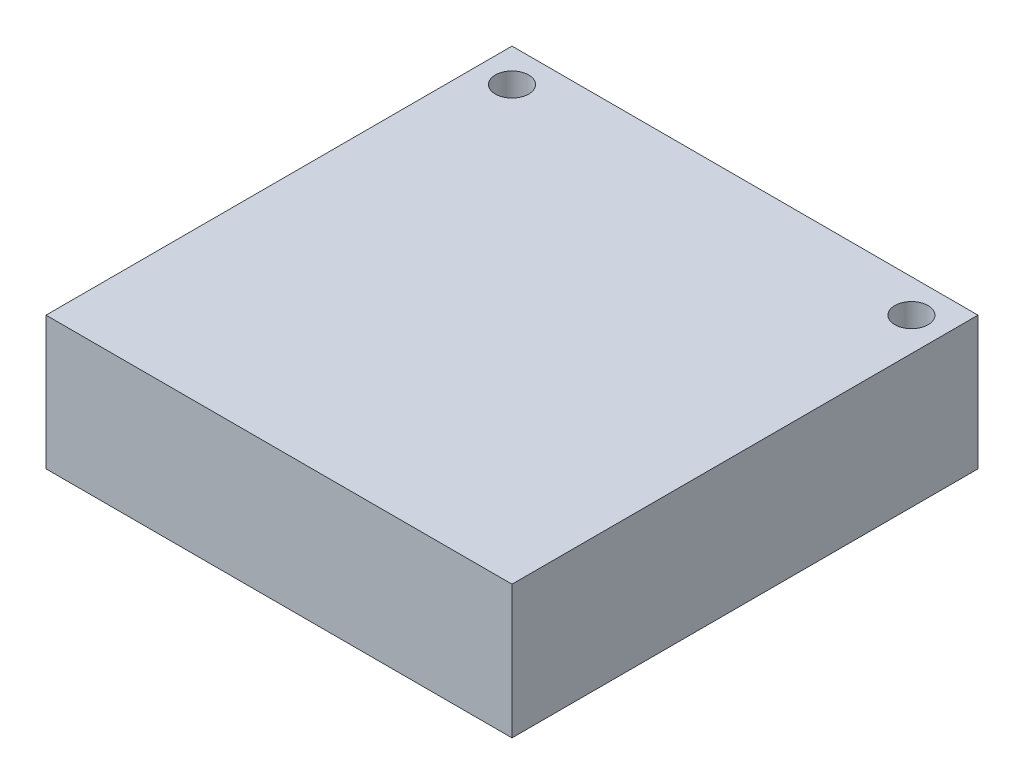
ISO-10303-21;
HEADER;
FILE_DESCRIPTION(('STEP AP214'),'2;1');
FILE_NAME('part.step','',(''),(''),'','','');
FILE_SCHEMA(('AUTOMOTIVE_DESIGN { 1 0 10303 214 1 1 1 1 }'));
ENDSEC;
DATA;
#1=APPLICATION_CONTEXT('core data for automotive mechanical design processes');
#2=APPLICATION_PROTOCOL_DEFINITION('international standard','automotive_design',2000,#1);
#3=PRODUCT_CONTEXT('',#1,'mechanical');
#4=PRODUCT('Part','Part','',(#3));
#5=PRODUCT_RELATED_PRODUCT_CATEGORY('part','',(#4));
#6=PRODUCT_DEFINITION_FORMATION('','',#4);
#7=PRODUCT_DEFINITION_CONTEXT('part definition',#1,'design');
#8=PRODUCT_DEFINITION('design','',#6,#7);
#9=PRODUCT_DEFINITION_SHAPE('','',#8);
#10=(LENGTH_UNIT() NAMED_UNIT(*) SI_UNIT(.MILLI.,.METRE.));
#11=(NAMED_UNIT(*) PLANE_ANGLE_UNIT() SI_UNIT($,.RADIAN.));
#12=(NAMED_UNIT(*) SI_UNIT($,.STERADIAN.) SOLID_ANGLE_UNIT());
#13=UNCERTAINTY_MEASURE_WITH_UNIT(LENGTH_MEASURE(1.E-05),#10,'distance_accuracy_value','');
#14=(GEOMETRIC_REPRESENTATION_CONTEXT(3) GLOBAL_UNCERTAINTY_ASSIGNED_CONTEXT((#13)) GLOBAL_UNIT_ASSIGNED_CONTEXT((#10,
#11,#12)) REPRESENTATION_CONTEXT('',''));
#15=CARTESIAN_POINT('',(0.,0.,0.));
#16=DIRECTION('',(0.,0.,1.));
#17=DIRECTION('',(1.,0.,0.));
#18=AXIS2_PLACEMENT_3D('',#15,#16,#17);
#19=CARTESIAN_POINT('',(0.,8.,0.));
#20=DIRECTION('',(-1.,0.,0.));
#21=DIRECTION('',(0.,0.,1.));
#22=AXIS2_PLACEMENT_3D('',#19,#20,#21);
#23=PLANE('',#22);
#24=DIRECTION('',(0.,0.,-1.));
#25=VECTOR('',#24,1.);
#26=CARTESIAN_POINT('',(0.,0.,0.));
#27=LINE('',#26,#25);
#28=CARTESIAN_POINT('',(0.,0.,28.));
#29=VERTEX_POINT('',#28);
#30=CARTESIAN_POINT('',(0.,0.,0.));
#31=VERTEX_POINT('',#30);
#32=EDGE_CURVE('E96',#29,#31,#27,.T.);
#33=ORIENTED_EDGE('',*,*,#32,.T.);
#34=DIRECTION('',(0.,-1.,0.));
#35=VECTOR('',#34,1.);
#36=CARTESIAN_POINT('',(0.,8.,0.));
#37=LINE('',#36,#35);
#38=CARTESIAN_POINT('',(0.,8.,0.));
#39=VERTEX_POINT('',#38);
#40=EDGE_CURVE('E11',#39,#31,#37,.T.);
#41=ORIENTED_EDGE('',*,*,#40,.F.);
#42=DIRECTION('',(0.,0.,-1.));
#43=VECTOR('',#42,1.);
#44=CARTESIAN_POINT('',(0.,8.,0.));
#45=LINE('',#44,#43);
#46=CARTESIAN_POINT('',(0.,8.,28.));
#47=VERTEX_POINT('',#46);
#48=EDGE_CURVE('E84',#47,#39,#45,.T.);
#49=ORIENTED_EDGE('',*,*,#48,.F.);
#50=DIRECTION('',(0.,-1.,0.));
#51=VECTOR('',#50,1.);
#52=CARTESIAN_POINT('',(0.,8.,28.));
#53=LINE('',#52,#51);
#54=EDGE_CURVE('E92',#47,#29,#53,.T.);
#55=ORIENTED_EDGE('',*,*,#54,.T.);
#56=EDGE_LOOP('',(#33,#41,#49,#55));
#57=FACE_BOUND('',#56,.T.);
#58=ADVANCED_FACE('F33',(#57),#23,.F.);
#59=CARTESIAN_POINT('',(0.,8.,0.));
#60=DIRECTION('',(0.,0.,1.));
#61=DIRECTION('',(1.,0.,0.));
#62=AXIS2_PLACEMENT_3D('',#59,#60,#61);
#63=PLANE('',#62);
#64=DIRECTION('',(-1.,0.,0.));
#65=VECTOR('',#64,1.);
#66=CARTESIAN_POINT('',(0.,0.,0.));
#67=LINE('',#66,#65);
#68=CARTESIAN_POINT('',(-28.,0.,0.));
#69=VERTEX_POINT('',#68);
#70=EDGE_CURVE('E88',#31,#69,#67,.T.);
#71=ORIENTED_EDGE('',*,*,#70,.T.);
#72=DIRECTION('',(0.,-1.,0.));
#73=VECTOR('',#72,1.);
#74=CARTESIAN_POINT('',(-28.,8.,0.));
#75=LINE('',#74,#73);
#76=CARTESIAN_POINT('',(-28.,8.,0.));
#77=VERTEX_POINT('',#76);
#78=EDGE_CURVE('E41',#77,#69,#75,.T.);
#79=ORIENTED_EDGE('',*,*,#78,.F.);
#80=DIRECTION('',(-1.,0.,0.));
#81=VECTOR('',#80,1.);
#82=CARTESIAN_POINT('',(0.,8.,0.));
#83=LINE('',#82,#81);
#84=EDGE_CURVE('E79',#39,#77,#83,.T.);
#85=ORIENTED_EDGE('',*,*,#84,.F.);
#86=ORIENTED_EDGE('',*,*,#40,.T.);
#87=EDGE_LOOP('',(#71,#79,#85,#86));
#88=FACE_BOUND('',#87,.T.);
#89=ADVANCED_FACE('F87',(#88),#63,.F.);
#90=CARTESIAN_POINT('',(-28.,8.,0.));
#91=DIRECTION('',(1.,0.,0.));
#92=DIRECTION('',(0.,0.,-1.));
#93=AXIS2_PLACEMENT_3D('',#90,#91,#92);
#94=PLANE('',#93);
#95=DIRECTION('',(0.,0.,1.));
#96=VECTOR('',#95,1.);
#97=CARTESIAN_POINT('',(-28.,0.,0.));
#98=LINE('',#97,#96);
#99=CARTESIAN_POINT('',(-28.,0.,28.));
#100=VERTEX_POINT('',#99);
#101=EDGE_CURVE('E66',#69,#100,#98,.T.);
#102=ORIENTED_EDGE('',*,*,#101,.T.);
#103=DIRECTION('',(0.,-1.,0.));
#104=VECTOR('',#103,1.);
#105=CARTESIAN_POINT('',(-28.,8.,28.));
#106=LINE('',#105,#104);
#107=CARTESIAN_POINT('',(-28.,8.,28.));
#108=VERTEX_POINT('',#107);
#109=EDGE_CURVE('E89',#108,#100,#106,.T.);
#110=ORIENTED_EDGE('',*,*,#109,.F.);
#111=DIRECTION('',(0.,0.,1.));
#112=VECTOR('',#111,1.);
#113=CARTESIAN_POINT('',(-28.,8.,0.));
#114=LINE('',#113,#112);
#115=EDGE_CURVE('E82',#77,#108,#114,.T.);
#116=ORIENTED_EDGE('',*,*,#115,.F.);
#117=ORIENTED_EDGE('',*,*,#78,.T.);
#118=EDGE_LOOP('',(#102,#110,#116,#117));
#119=FACE_BOUND('',#118,.T.);
#120=ADVANCED_FACE('F90',(#119),#94,.F.);
#121=CARTESIAN_POINT('',(0.,8.,28.));
#122=DIRECTION('',(0.,0.,-1.));
#123=DIRECTION('',(-1.,0.,0.));
#124=AXIS2_PLACEMENT_3D('',#121,#122,#123);
#125=PLANE('',#124);
#126=DIRECTION('',(1.,0.,0.));
#127=VECTOR('',#126,1.);
#128=CARTESIAN_POINT('',(0.,0.,28.));
#129=LINE('',#128,#127);
#130=EDGE_CURVE('E72',#100,#29,#129,.T.);
#131=ORIENTED_EDGE('',*,*,#130,.T.);
#132=ORIENTED_EDGE('',*,*,#54,.F.);
#133=DIRECTION('',(1.,0.,0.));
#134=VECTOR('',#133,1.);
#135=CARTESIAN_POINT('',(0.,8.,28.));
#136=LINE('',#135,#134);
#137=EDGE_CURVE('E49',#108,#47,#136,.T.);
#138=ORIENTED_EDGE('',*,*,#137,.F.);
#139=ORIENTED_EDGE('',*,*,#109,.T.);
#140=EDGE_LOOP('',(#131,#132,#138,#139));
#141=FACE_BOUND('',#140,.T.);
#142=ADVANCED_FACE('F104',(#141),#125,.F.);
#143=CARTESIAN_POINT('',(0.,8.,0.));
#144=DIRECTION('',(0.,-1.,0.));
#145=DIRECTION('',(0.,0.,-1.));
#146=AXIS2_PLACEMENT_3D('',#143,#144,#145);
#147=PLANE('',#146);
#148=CARTESIAN_POINT('',(-26.,8.,2.));
#149=DIRECTION('',(0.,1.,0.));
#150=DIRECTION('',(0.,0.,1.));
#151=AXIS2_PLACEMENT_3D('',#148,#149,#150);
#152=CIRCLE('',#151,1.);
#153=CARTESIAN_POINT('',(-26.,8.,3.));
#154=VERTEX_POINT('',#153);
#155=EDGE_CURVE('E116',#154,#154,#152,.T.);
#156=ORIENTED_EDGE('',*,*,#155,.F.);
#157=EDGE_LOOP('',(#156));
#158=FACE_BOUND('',#157,.T.);
#159=CARTESIAN_POINT('',(-1.99999999999999,8.,2.));
#160=DIRECTION('',(0.,1.,0.));
#161=DIRECTION('',(0.,0.,1.));
#162=AXIS2_PLACEMENT_3D('',#159,#160,#161);
#163=CIRCLE('',#162,1.);
#164=CARTESIAN_POINT('',(-1.99999999999999,8.,3.));
#165=VERTEX_POINT('',#164);
#166=EDGE_CURVE('E110',#165,#165,#163,.T.);
#167=ORIENTED_EDGE('',*,*,#166,.F.);
#168=EDGE_LOOP('',(#167));
#169=FACE_BOUND('',#168,.T.);
#170=ORIENTED_EDGE('',*,*,#48,.T.);
#171=ORIENTED_EDGE('',*,*,#84,.T.);
#172=ORIENTED_EDGE('',*,*,#115,.T.);
#173=ORIENTED_EDGE('',*,*,#137,.T.);
#174=EDGE_LOOP('',(#170,#171,#172,#173));
#175=FACE_BOUND('',#174,.T.);
#176=ADVANCED_FACE('F80',(#158,#169,#175),#147,.F.);
#177=CARTESIAN_POINT('',(0.,0.,0.));
#178=DIRECTION('',(0.,-1.,0.));
#179=DIRECTION('',(0.,0.,-1.));
#180=AXIS2_PLACEMENT_3D('',#177,#178,#179);
#181=PLANE('',#180);
#182=CARTESIAN_POINT('',(-26.,0.,2.));
#183=DIRECTION('',(0.,1.,0.));
#184=DIRECTION('',(0.,0.,1.));
#185=AXIS2_PLACEMENT_3D('',#182,#183,#184);
#186=CIRCLE('',#185,1.);
#187=CARTESIAN_POINT('',(-26.,0.,3.));
#188=VERTEX_POINT('',#187);
#189=EDGE_CURVE('E99',#188,#188,#186,.T.);
#190=ORIENTED_EDGE('',*,*,#189,.T.);
#191=EDGE_LOOP('',(#190));
#192=FACE_BOUND('',#191,.T.);
#193=CARTESIAN_POINT('',(-1.99999999999999,0.,2.));
#194=DIRECTION('',(0.,1.,0.));
#195=DIRECTION('',(0.,0.,1.));
#196=AXIS2_PLACEMENT_3D('',#193,#194,#195);
#197=CIRCLE('',#196,1.);
#198=CARTESIAN_POINT('',(-1.99999999999999,0.,3.));
#199=VERTEX_POINT('',#198);
#200=EDGE_CURVE('E113',#199,#199,#197,.T.);
#201=ORIENTED_EDGE('',*,*,#200,.T.);
#202=EDGE_LOOP('',(#201));
#203=FACE_BOUND('',#202,.T.);
#204=ORIENTED_EDGE('',*,*,#32,.F.);
#205=ORIENTED_EDGE('',*,*,#130,.F.);
#206=ORIENTED_EDGE('',*,*,#101,.F.);
#207=ORIENTED_EDGE('',*,*,#70,.F.);
#208=EDGE_LOOP('',(#204,#205,#206,#207));
#209=FACE_BOUND('',#208,.T.);
#210=ADVANCED_FACE('F107',(#192,#203,#209),#181,.T.);
#211=CARTESIAN_POINT('',(-1.99999999999999,0.,2.));
#212=DIRECTION('',(0.,1.,0.));
#213=DIRECTION('',(0.,0.,1.));
#214=AXIS2_PLACEMENT_3D('',#211,#212,#213);
#215=CYLINDRICAL_SURFACE('',#214,1.);
#216=ORIENTED_EDGE('',*,*,#200,.F.);
#217=EDGE_LOOP('',(#216));
#218=FACE_BOUND('',#217,.T.);
#219=ORIENTED_EDGE('',*,*,#166,.T.);
#220=EDGE_LOOP('',(#219));
#221=FACE_BOUND('',#220,.T.);
#222=ADVANCED_FACE('F127',(#218,#221),#215,.F.);
#223=CARTESIAN_POINT('',(-26.,0.,2.));
#224=DIRECTION('',(0.,1.,0.));
#225=DIRECTION('',(0.,0.,1.));
#226=AXIS2_PLACEMENT_3D('',#223,#224,#225);
#227=CYLINDRICAL_SURFACE('',#226,1.);
#228=ORIENTED_EDGE('',*,*,#189,.F.);
#229=EDGE_LOOP('',(#228));
#230=FACE_BOUND('',#229,.T.);
#231=ORIENTED_EDGE('',*,*,#155,.T.);
#232=EDGE_LOOP('',(#231));
#233=FACE_BOUND('',#232,.T.);
#234=ADVANCED_FACE('F124',(#230,#233),#227,.F.);
#235=CLOSED_SHELL('',(#58,#89,#120,#142,#176,#210,#222,#234));
#236=MANIFOLD_SOLID_BREP('B2',#235);
#237=ADVANCED_BREP_SHAPE_REPRESENTATION('',(#18,#236),#14);
#238=SHAPE_DEFINITION_REPRESENTATION(#9,#237);
ENDSEC;
END-ISO-10303-21;
